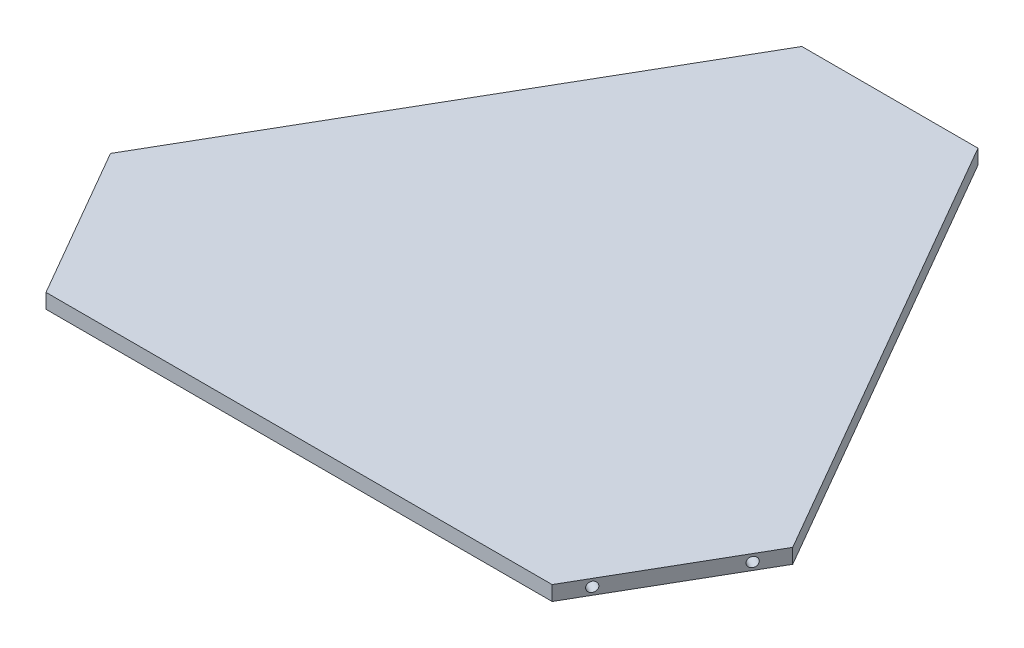
ISO-10303-21;
HEADER;
FILE_DESCRIPTION(('STEP AP214'),'2;1');
FILE_NAME('part.step','',(''),(''),'','','');
FILE_SCHEMA(('AUTOMOTIVE_DESIGN { 1 0 10303 214 1 1 1 1 }'));
ENDSEC;
DATA;
#1=APPLICATION_CONTEXT('core data for automotive mechanical design processes');
#2=APPLICATION_PROTOCOL_DEFINITION('international standard','automotive_design',2000,#1);
#3=PRODUCT_CONTEXT('',#1,'mechanical');
#4=PRODUCT('Part','Part','',(#3));
#5=PRODUCT_RELATED_PRODUCT_CATEGORY('part','',(#4));
#6=PRODUCT_DEFINITION_FORMATION('','',#4);
#7=PRODUCT_DEFINITION_CONTEXT('part definition',#1,'design');
#8=PRODUCT_DEFINITION('design','',#6,#7);
#9=PRODUCT_DEFINITION_SHAPE('','',#8);
#10=(LENGTH_UNIT() NAMED_UNIT(*) SI_UNIT(.MILLI.,.METRE.));
#11=(NAMED_UNIT(*) PLANE_ANGLE_UNIT() SI_UNIT($,.RADIAN.));
#12=(NAMED_UNIT(*) SI_UNIT($,.STERADIAN.) SOLID_ANGLE_UNIT());
#13=UNCERTAINTY_MEASURE_WITH_UNIT(LENGTH_MEASURE(1.E-05),#10,'distance_accuracy_value','');
#14=(GEOMETRIC_REPRESENTATION_CONTEXT(3) GLOBAL_UNCERTAINTY_ASSIGNED_CONTEXT((#13)) GLOBAL_UNIT_ASSIGNED_CONTEXT((#10,
#11,#12)) REPRESENTATION_CONTEXT('',''));
#15=CARTESIAN_POINT('',(0.,0.,0.));
#16=DIRECTION('',(0.,0.,1.));
#17=DIRECTION('',(1.,0.,0.));
#18=AXIS2_PLACEMENT_3D('',#15,#16,#17);
#19=CARTESIAN_POINT('',(-38.1,6.35,-148.4264));
#20=DIRECTION('',(0.866025403784439,0.,0.5));
#21=DIRECTION('',(0.5,0.,-0.866025403784439));
#22=AXIS2_PLACEMENT_3D('',#19,#20,#21);
#23=PLANE('',#22);
#24=DIRECTION('',(-0.5,0.,0.866025403784439));
#25=VECTOR('',#24,1.);
#26=CARTESIAN_POINT('',(-38.1,0.,-148.4264));
#27=LINE('',#26,#25);
#28=CARTESIAN_POINT('',(-38.1,0.,-148.4264));
#29=VERTEX_POINT('',#28);
#30=CARTESIAN_POINT('',(-147.59103299227,0.,41.2176321158125));
#31=VERTEX_POINT('',#30);
#32=EDGE_CURVE('E123',#29,#31,#27,.T.);
#33=ORIENTED_EDGE('',*,*,#32,.T.);
#34=DIRECTION('',(0.,-1.,0.));
#35=VECTOR('',#34,1.);
#36=CARTESIAN_POINT('',(-147.59103299227,6.35,41.2176321158125));
#37=LINE('',#36,#35);
#38=CARTESIAN_POINT('',(-147.59103299227,6.35,41.2176321158125));
#39=VERTEX_POINT('',#38);
#40=EDGE_CURVE('E11',#39,#31,#37,.T.);
#41=ORIENTED_EDGE('',*,*,#40,.F.);
#42=DIRECTION('',(-0.5,0.,0.866025403784439));
#43=VECTOR('',#42,1.);
#44=CARTESIAN_POINT('',(-38.1,6.35,-148.4264));
#45=LINE('',#44,#43);
#46=CARTESIAN_POINT('',(-38.1,6.35,-148.4264));
#47=VERTEX_POINT('',#46);
#48=EDGE_CURVE('E134',#47,#39,#45,.T.);
#49=ORIENTED_EDGE('',*,*,#48,.F.);
#50=DIRECTION('',(0.,-1.,0.));
#51=VECTOR('',#50,1.);
#52=CARTESIAN_POINT('',(-38.1,6.35,-148.4264));
#53=LINE('',#52,#51);
#54=EDGE_CURVE('E119',#47,#29,#53,.T.);
#55=ORIENTED_EDGE('',*,*,#54,.T.);
#56=EDGE_LOOP('',(#33,#41,#49,#55));
#57=FACE_BOUND('',#56,.T.);
#58=ADVANCED_FACE('F36',(#57),#23,.F.);
#59=CARTESIAN_POINT('',(-147.59103299227,6.35,41.2176321158125));
#60=DIRECTION('',(0.866025403784437,0.,-0.500000000000002));
#61=DIRECTION('',(-0.500000000000002,0.,-0.866025403784438));
#62=AXIS2_PLACEMENT_3D('',#59,#60,#61);
#63=PLANE('',#62);
#64=CARTESIAN_POINT('',(-141.241032992271,3.175,52.2161547438741));
#65=DIRECTION('',(-0.866025403784442,0.,0.499999999999995));
#66=DIRECTION('',(0.499999999999995,0.,0.866025403784442));
#67=AXIS2_PLACEMENT_3D('',#64,#65,#66);
#68=CIRCLE('',#67,2.09999999999999);
#69=CARTESIAN_POINT('',(-140.191032992271,3.175,54.0348080918214));
#70=VERTEX_POINT('',#69);
#71=EDGE_CURVE('E204',#70,#70,#68,.T.);
#72=ORIENTED_EDGE('',*,*,#71,.F.);
#73=EDGE_LOOP('',(#72));
#74=FACE_BOUND('',#73,.T.);
#75=CARTESIAN_POINT('',(-115.841032992271,3.175,96.2102452561238));
#76=DIRECTION('',(-0.866025403784442,0.,0.499999999999995));
#77=DIRECTION('',(0.499999999999995,0.,0.866025403784442));
#78=AXIS2_PLACEMENT_3D('',#75,#76,#77);
#79=CIRCLE('',#78,2.09999999999999);
#80=CARTESIAN_POINT('',(-114.791032992271,3.175,98.0288986040711));
#81=VERTEX_POINT('',#80);
#82=EDGE_CURVE('E198',#81,#81,#79,.T.);
#83=ORIENTED_EDGE('',*,*,#82,.F.);
#84=EDGE_LOOP('',(#83));
#85=FACE_BOUND('',#84,.T.);
#86=DIRECTION('',(0.500000000000002,0.,0.866025403784438));
#87=VECTOR('',#86,1.);
#88=CARTESIAN_POINT('',(-147.59103299227,0.,41.2176321158125));
#89=LINE('',#88,#87);
#90=CARTESIAN_POINT('',(-109.49103299227,0.,107.208767884187));
#91=VERTEX_POINT('',#90);
#92=EDGE_CURVE('E126',#31,#91,#89,.T.);
#93=ORIENTED_EDGE('',*,*,#92,.T.);
#94=DIRECTION('',(0.,-1.,0.));
#95=VECTOR('',#94,1.);
#96=CARTESIAN_POINT('',(-109.49103299227,6.35,107.208767884187));
#97=LINE('',#96,#95);
#98=CARTESIAN_POINT('',(-109.49103299227,6.35,107.208767884187));
#99=VERTEX_POINT('',#98);
#100=EDGE_CURVE('E44',#99,#91,#97,.T.);
#101=ORIENTED_EDGE('',*,*,#100,.F.);
#102=DIRECTION('',(0.500000000000002,0.,0.866025403784438));
#103=VECTOR('',#102,1.);
#104=CARTESIAN_POINT('',(-147.59103299227,6.35,41.2176321158125));
#105=LINE('',#104,#103);
#106=EDGE_CURVE('E90',#39,#99,#105,.T.);
#107=ORIENTED_EDGE('',*,*,#106,.F.);
#108=ORIENTED_EDGE('',*,*,#40,.T.);
#109=EDGE_LOOP('',(#93,#101,#107,#108));
#110=FACE_BOUND('',#109,.T.);
#111=ADVANCED_FACE('F161',(#74,#85,#110),#63,.F.);
#112=CARTESIAN_POINT('',(-109.49103299227,6.35,107.208767884187));
#113=DIRECTION('',(0.,0.,-1.));
#114=DIRECTION('',(-1.,0.,0.));
#115=AXIS2_PLACEMENT_3D('',#112,#113,#114);
#116=PLANE('',#115);
#117=DIRECTION('',(1.,0.,0.));
#118=VECTOR('',#117,1.);
#119=CARTESIAN_POINT('',(-109.49103299227,0.,107.208767884187));
#120=LINE('',#119,#118);
#121=CARTESIAN_POINT('',(109.49103299227,0.,107.208767884187));
#122=VERTEX_POINT('',#121);
#123=EDGE_CURVE('E129',#91,#122,#120,.T.);
#124=ORIENTED_EDGE('',*,*,#123,.T.);
#125=DIRECTION('',(0.,-1.,0.));
#126=VECTOR('',#125,1.);
#127=CARTESIAN_POINT('',(109.49103299227,6.35,107.208767884187));
#128=LINE('',#127,#126);
#129=CARTESIAN_POINT('',(109.49103299227,6.35,107.208767884187));
#130=VERTEX_POINT('',#129);
#131=EDGE_CURVE('E114',#130,#122,#128,.T.);
#132=ORIENTED_EDGE('',*,*,#131,.F.);
#133=DIRECTION('',(1.,0.,0.));
#134=VECTOR('',#133,1.);
#135=CARTESIAN_POINT('',(-109.49103299227,6.35,107.208767884187));
#136=LINE('',#135,#134);
#137=EDGE_CURVE('E105',#99,#130,#136,.T.);
#138=ORIENTED_EDGE('',*,*,#137,.F.);
#139=ORIENTED_EDGE('',*,*,#100,.T.);
#140=EDGE_LOOP('',(#124,#132,#138,#139));
#141=FACE_BOUND('',#140,.T.);
#142=ADVANCED_FACE('F140',(#141),#116,.F.);
#143=CARTESIAN_POINT('',(109.49103299227,6.35,107.208767884187));
#144=DIRECTION('',(-0.866025403784437,0.,-0.500000000000003));
#145=DIRECTION('',(-0.500000000000003,0.,0.866025403784437));
#146=AXIS2_PLACEMENT_3D('',#143,#144,#145);
#147=PLANE('',#146);
#148=CARTESIAN_POINT('',(115.84103299227,3.175,96.2102452561251));
#149=DIRECTION('',(0.866025403784438,0.,0.500000000000002));
#150=DIRECTION('',(0.500000000000002,0.,-0.866025403784438));
#151=AXIS2_PLACEMENT_3D('',#148,#149,#150);
#152=CIRCLE('',#151,2.09999999999999);
#153=CARTESIAN_POINT('',(116.89103299227,3.175,94.3915919081778));
#154=VERTEX_POINT('',#153);
#155=EDGE_CURVE('E180',#154,#154,#152,.T.);
#156=ORIENTED_EDGE('',*,*,#155,.F.);
#157=EDGE_LOOP('',(#156));
#158=FACE_BOUND('',#157,.T.);
#159=CARTESIAN_POINT('',(141.24103299227,3.175,52.2161547438757));
#160=DIRECTION('',(0.866025403784438,0.,0.500000000000002));
#161=DIRECTION('',(0.500000000000002,0.,-0.866025403784438));
#162=AXIS2_PLACEMENT_3D('',#159,#160,#161);
#163=CIRCLE('',#162,2.09999999999999);
#164=CARTESIAN_POINT('',(142.29103299227,3.175,50.3975013959284));
#165=VERTEX_POINT('',#164);
#166=EDGE_CURVE('E183',#165,#165,#163,.T.);
#167=ORIENTED_EDGE('',*,*,#166,.F.);
#168=EDGE_LOOP('',(#167));
#169=FACE_BOUND('',#168,.T.);
#170=DIRECTION('',(0.500000000000003,0.,-0.866025403784437));
#171=VECTOR('',#170,1.);
#172=CARTESIAN_POINT('',(109.49103299227,0.,107.208767884187));
#173=LINE('',#172,#171);
#174=CARTESIAN_POINT('',(147.591032992271,0.,41.217632115813));
#175=VERTEX_POINT('',#174);
#176=EDGE_CURVE('E113',#122,#175,#173,.T.);
#177=ORIENTED_EDGE('',*,*,#176,.T.);
#178=DIRECTION('',(0.,-1.,0.));
#179=VECTOR('',#178,1.);
#180=CARTESIAN_POINT('',(147.591032992271,6.35,41.217632115813));
#181=LINE('',#180,#179);
#182=CARTESIAN_POINT('',(147.591032992271,6.35,41.217632115813));
#183=VERTEX_POINT('',#182);
#184=EDGE_CURVE('E110',#183,#175,#181,.T.);
#185=ORIENTED_EDGE('',*,*,#184,.F.);
#186=DIRECTION('',(0.500000000000003,0.,-0.866025403784437));
#187=VECTOR('',#186,1.);
#188=CARTESIAN_POINT('',(109.49103299227,6.35,107.208767884187));
#189=LINE('',#188,#187);
#190=EDGE_CURVE('E99',#130,#183,#189,.T.);
#191=ORIENTED_EDGE('',*,*,#190,.F.);
#192=ORIENTED_EDGE('',*,*,#131,.T.);
#193=EDGE_LOOP('',(#177,#185,#191,#192));
#194=FACE_BOUND('',#193,.T.);
#195=ADVANCED_FACE('F111',(#158,#169,#194),#147,.F.);
#196=CARTESIAN_POINT('',(147.591032992271,6.35,41.217632115813));
#197=DIRECTION('',(-0.866025403784439,0.,0.5));
#198=DIRECTION('',(0.5,0.,0.866025403784439));
#199=AXIS2_PLACEMENT_3D('',#196,#197,#198);
#200=PLANE('',#199);
#201=DIRECTION('',(-0.5,0.,-0.866025403784439));
#202=VECTOR('',#201,1.);
#203=CARTESIAN_POINT('',(147.591032992271,0.,41.217632115813));
#204=LINE('',#203,#202);
#205=CARTESIAN_POINT('',(38.1,0.,-148.4264));
#206=VERTEX_POINT('',#205);
#207=EDGE_CURVE('E76',#175,#206,#204,.T.);
#208=ORIENTED_EDGE('',*,*,#207,.T.);
#209=DIRECTION('',(0.,-1.,0.));
#210=VECTOR('',#209,1.);
#211=CARTESIAN_POINT('',(38.1,6.35,-148.4264));
#212=LINE('',#211,#210);
#213=CARTESIAN_POINT('',(38.1,6.35,-148.4264));
#214=VERTEX_POINT('',#213);
#215=EDGE_CURVE('E115',#214,#206,#212,.T.);
#216=ORIENTED_EDGE('',*,*,#215,.F.);
#217=DIRECTION('',(-0.5,0.,-0.866025403784439));
#218=VECTOR('',#217,1.);
#219=CARTESIAN_POINT('',(147.591032992271,6.35,41.217632115813));
#220=LINE('',#219,#218);
#221=EDGE_CURVE('E103',#183,#214,#220,.T.);
#222=ORIENTED_EDGE('',*,*,#221,.F.);
#223=ORIENTED_EDGE('',*,*,#184,.T.);
#224=EDGE_LOOP('',(#208,#216,#222,#223));
#225=FACE_BOUND('',#224,.T.);
#226=ADVANCED_FACE('F117',(#225),#200,.F.);
#227=CARTESIAN_POINT('',(38.1,6.35,-148.4264));
#228=DIRECTION('',(0.,0.,1.));
#229=DIRECTION('',(1.,0.,0.));
#230=AXIS2_PLACEMENT_3D('',#227,#228,#229);
#231=PLANE('',#230);
#232=CARTESIAN_POINT('',(25.4000000000019,3.175,-148.4264));
#233=DIRECTION('',(0.,0.,-1.));
#234=DIRECTION('',(-1.,0.,0.));
#235=AXIS2_PLACEMENT_3D('',#232,#233,#234);
#236=CIRCLE('',#235,2.09999999999999);
#237=CARTESIAN_POINT('',(23.3000000000019,3.175,-148.4264));
#238=VERTEX_POINT('',#237);
#239=EDGE_CURVE('E216',#238,#238,#236,.T.);
#240=ORIENTED_EDGE('',*,*,#239,.F.);
#241=EDGE_LOOP('',(#240));
#242=FACE_BOUND('',#241,.T.);
#243=CARTESIAN_POINT('',(-25.3999999999981,3.175,-148.4264));
#244=DIRECTION('',(0.,0.,-1.));
#245=DIRECTION('',(-1.,0.,0.));
#246=AXIS2_PLACEMENT_3D('',#243,#244,#245);
#247=CIRCLE('',#246,2.09999999999999);
#248=CARTESIAN_POINT('',(-27.4999999999981,3.175,-148.4264));
#249=VERTEX_POINT('',#248);
#250=EDGE_CURVE('E210',#249,#249,#247,.T.);
#251=ORIENTED_EDGE('',*,*,#250,.F.);
#252=EDGE_LOOP('',(#251));
#253=FACE_BOUND('',#252,.T.);
#254=DIRECTION('',(-1.,0.,0.));
#255=VECTOR('',#254,1.);
#256=CARTESIAN_POINT('',(38.1,0.,-148.4264));
#257=LINE('',#256,#255);
#258=EDGE_CURVE('E82',#206,#29,#257,.T.);
#259=ORIENTED_EDGE('',*,*,#258,.T.);
#260=ORIENTED_EDGE('',*,*,#54,.F.);
#261=DIRECTION('',(-1.,0.,0.));
#262=VECTOR('',#261,1.);
#263=CARTESIAN_POINT('',(38.1,6.35,-148.4264));
#264=LINE('',#263,#262);
#265=EDGE_CURVE('E52',#214,#47,#264,.T.);
#266=ORIENTED_EDGE('',*,*,#265,.F.);
#267=ORIENTED_EDGE('',*,*,#215,.T.);
#268=EDGE_LOOP('',(#259,#260,#266,#267));
#269=FACE_BOUND('',#268,.T.);
#270=ADVANCED_FACE('F147',(#242,#253,#269),#231,.F.);
#271=CARTESIAN_POINT('',(0.,6.35,0.));
#272=DIRECTION('',(0.,1.,0.));
#273=DIRECTION('',(0.,0.,1.));
#274=AXIS2_PLACEMENT_3D('',#271,#272,#273);
#275=PLANE('',#274);
#276=ORIENTED_EDGE('',*,*,#48,.T.);
#277=ORIENTED_EDGE('',*,*,#106,.T.);
#278=ORIENTED_EDGE('',*,*,#137,.T.);
#279=ORIENTED_EDGE('',*,*,#190,.T.);
#280=ORIENTED_EDGE('',*,*,#221,.T.);
#281=ORIENTED_EDGE('',*,*,#265,.T.);
#282=EDGE_LOOP('',(#276,#277,#278,#279,#280,#281));
#283=FACE_BOUND('',#282,.T.);
#284=ADVANCED_FACE('F101',(#283),#275,.T.);
#285=CARTESIAN_POINT('',(0.,0.,0.));
#286=DIRECTION('',(0.,1.,0.));
#287=DIRECTION('',(0.,0.,1.));
#288=AXIS2_PLACEMENT_3D('',#285,#286,#287);
#289=PLANE('',#288);
#290=ORIENTED_EDGE('',*,*,#32,.F.);
#291=ORIENTED_EDGE('',*,*,#258,.F.);
#292=ORIENTED_EDGE('',*,*,#207,.F.);
#293=ORIENTED_EDGE('',*,*,#176,.F.);
#294=ORIENTED_EDGE('',*,*,#123,.F.);
#295=ORIENTED_EDGE('',*,*,#92,.F.);
#296=EDGE_LOOP('',(#290,#291,#292,#293,#294,#295));
#297=FACE_BOUND('',#296,.T.);
#298=ADVANCED_FACE('F143',(#297),#289,.F.);
#299=CARTESIAN_POINT('',(130.242510364208,3.175,45.8661547438757));
#300=DIRECTION('',(0.866025403784438,0.,0.500000000000002));
#301=DIRECTION('',(0.500000000000002,0.,-0.866025403784438));
#302=AXIS2_PLACEMENT_3D('',#299,#300,#301);
#303=CONICAL_SURFACE('',#302,2.1,1.02974425867666);
#304=CARTESIAN_POINT('',(129.149753187764,3.175,45.2352510938967));
#305=VERTEX_POINT('',#304);
#306=VERTEX_LOOP('',#305);
#307=FACE_BOUND('',#306,.T.);
#308=CARTESIAN_POINT('',(130.242510364208,3.175,45.8661547438757));
#309=DIRECTION('',(0.866025403784438,0.,0.500000000000002));
#310=DIRECTION('',(0.500000000000002,0.,-0.866025403784438));
#311=AXIS2_PLACEMENT_3D('',#308,#309,#310);
#312=CIRCLE('',#311,2.1);
#313=CARTESIAN_POINT('',(131.292510364208,3.175,44.0475013959284));
#314=VERTEX_POINT('',#313);
#315=EDGE_CURVE('E127',#314,#314,#312,.T.);
#316=ORIENTED_EDGE('',*,*,#315,.T.);
#317=EDGE_LOOP('',(#316));
#318=FACE_BOUND('',#317,.T.);
#319=ADVANCED_FACE('F266',(#307,#318),#303,.F.);
#320=CARTESIAN_POINT('',(141.24103299227,3.175,52.2161547438757));
#321=DIRECTION('',(0.866025403784438,0.,0.500000000000002));
#322=DIRECTION('',(0.500000000000002,0.,-0.866025403784438));
#323=AXIS2_PLACEMENT_3D('',#320,#321,#322);
#324=CYLINDRICAL_SURFACE('',#323,2.09999999999999);
#325=ORIENTED_EDGE('',*,*,#315,.F.);
#326=EDGE_LOOP('',(#325));
#327=FACE_BOUND('',#326,.T.);
#328=ORIENTED_EDGE('',*,*,#166,.T.);
#329=EDGE_LOOP('',(#328));
#330=FACE_BOUND('',#329,.T.);
#331=ADVANCED_FACE('F262',(#327,#330),#324,.F.);
#332=CARTESIAN_POINT('',(104.842510364208,3.175,89.8602452561251));
#333=DIRECTION('',(0.866025403784438,0.,0.500000000000002));
#334=DIRECTION('',(0.500000000000002,0.,-0.866025403784438));
#335=AXIS2_PLACEMENT_3D('',#332,#333,#334);
#336=CONICAL_SURFACE('',#335,2.1,1.02974425867666);
#337=CARTESIAN_POINT('',(103.749753187764,3.175,89.2293416061462));
#338=VERTEX_POINT('',#337);
#339=VERTEX_LOOP('',#338);
#340=FACE_BOUND('',#339,.T.);
#341=CARTESIAN_POINT('',(104.842510364208,3.175,89.8602452561251));
#342=DIRECTION('',(0.866025403784438,0.,0.500000000000002));
#343=DIRECTION('',(0.500000000000002,0.,-0.866025403784438));
#344=AXIS2_PLACEMENT_3D('',#341,#342,#343);
#345=CIRCLE('',#344,2.1);
#346=CARTESIAN_POINT('',(105.892510364208,3.175,88.0415919081778));
#347=VERTEX_POINT('',#346);
#348=EDGE_CURVE('E185',#347,#347,#345,.T.);
#349=ORIENTED_EDGE('',*,*,#348,.T.);
#350=EDGE_LOOP('',(#349));
#351=FACE_BOUND('',#350,.T.);
#352=ADVANCED_FACE('F258',(#340,#351),#336,.F.);
#353=CARTESIAN_POINT('',(115.84103299227,3.175,96.2102452561251));
#354=DIRECTION('',(0.866025403784438,0.,0.500000000000002));
#355=DIRECTION('',(0.500000000000002,0.,-0.866025403784438));
#356=AXIS2_PLACEMENT_3D('',#353,#354,#355);
#357=CYLINDRICAL_SURFACE('',#356,2.09999999999999);
#358=ORIENTED_EDGE('',*,*,#348,.F.);
#359=EDGE_LOOP('',(#358));
#360=FACE_BOUND('',#359,.T.);
#361=ORIENTED_EDGE('',*,*,#155,.T.);
#362=EDGE_LOOP('',(#361));
#363=FACE_BOUND('',#362,.T.);
#364=ADVANCED_FACE('F254',(#360,#363),#357,.F.);
#365=CARTESIAN_POINT('',(-104.842510364209,3.175,89.8602452561239));
#366=DIRECTION('',(-0.866025403784442,0.,0.499999999999995));
#367=DIRECTION('',(0.499999999999995,0.,0.866025403784442));
#368=AXIS2_PLACEMENT_3D('',#365,#366,#367);
#369=CONICAL_SURFACE('',#368,2.1,1.02974425867665);
#370=CARTESIAN_POINT('',(-103.749753187765,3.175,89.2293416061449));
#371=VERTEX_POINT('',#370);
#372=VERTEX_LOOP('',#371);
#373=FACE_BOUND('',#372,.T.);
#374=CARTESIAN_POINT('',(-104.842510364209,3.175,89.8602452561239));
#375=DIRECTION('',(-0.866025403784442,0.,0.499999999999995));
#376=DIRECTION('',(0.499999999999995,0.,0.866025403784442));
#377=AXIS2_PLACEMENT_3D('',#374,#375,#376);
#378=CIRCLE('',#377,2.1);
#379=CARTESIAN_POINT('',(-103.792510364209,3.175,91.6788986040712));
#380=VERTEX_POINT('',#379);
#381=EDGE_CURVE('E195',#380,#380,#378,.T.);
#382=ORIENTED_EDGE('',*,*,#381,.T.);
#383=EDGE_LOOP('',(#382));
#384=FACE_BOUND('',#383,.T.);
#385=ADVANCED_FACE('F250',(#373,#384),#369,.F.);
#386=CARTESIAN_POINT('',(-115.841032992271,3.175,96.2102452561238));
#387=DIRECTION('',(-0.866025403784442,0.,0.499999999999995));
#388=DIRECTION('',(0.499999999999995,0.,0.866025403784442));
#389=AXIS2_PLACEMENT_3D('',#386,#387,#388);
#390=CYLINDRICAL_SURFACE('',#389,2.09999999999999);
#391=ORIENTED_EDGE('',*,*,#381,.F.);
#392=EDGE_LOOP('',(#391));
#393=FACE_BOUND('',#392,.T.);
#394=ORIENTED_EDGE('',*,*,#82,.T.);
#395=EDGE_LOOP('',(#394));
#396=FACE_BOUND('',#395,.T.);
#397=ADVANCED_FACE('F246',(#393,#396),#390,.F.);
#398=CARTESIAN_POINT('',(-130.242510364209,3.175,45.8661547438742));
#399=DIRECTION('',(-0.866025403784442,0.,0.499999999999995));
#400=DIRECTION('',(0.499999999999995,0.,0.866025403784442));
#401=AXIS2_PLACEMENT_3D('',#398,#399,#400);
#402=CONICAL_SURFACE('',#401,2.1,1.02974425867666);
#403=CARTESIAN_POINT('',(-129.149753187764,3.175,45.2352510938953));
#404=VERTEX_POINT('',#403);
#405=VERTEX_LOOP('',#404);
#406=FACE_BOUND('',#405,.T.);
#407=CARTESIAN_POINT('',(-130.242510364209,3.175,45.8661547438742));
#408=DIRECTION('',(-0.866025403784442,0.,0.499999999999995));
#409=DIRECTION('',(0.499999999999995,0.,0.866025403784442));
#410=AXIS2_PLACEMENT_3D('',#407,#408,#409);
#411=CIRCLE('',#410,2.1);
#412=CARTESIAN_POINT('',(-129.192510364209,3.175,47.6848080918215));
#413=VERTEX_POINT('',#412);
#414=EDGE_CURVE('E201',#413,#413,#411,.T.);
#415=ORIENTED_EDGE('',*,*,#414,.T.);
#416=EDGE_LOOP('',(#415));
#417=FACE_BOUND('',#416,.T.);
#418=ADVANCED_FACE('F242',(#406,#417),#402,.F.);
#419=CARTESIAN_POINT('',(-141.241032992271,3.175,52.2161547438741));
#420=DIRECTION('',(-0.866025403784442,0.,0.499999999999995));
#421=DIRECTION('',(0.499999999999995,0.,0.866025403784442));
#422=AXIS2_PLACEMENT_3D('',#419,#420,#421);
#423=CYLINDRICAL_SURFACE('',#422,2.09999999999999);
#424=ORIENTED_EDGE('',*,*,#414,.F.);
#425=EDGE_LOOP('',(#424));
#426=FACE_BOUND('',#425,.T.);
#427=ORIENTED_EDGE('',*,*,#71,.T.);
#428=EDGE_LOOP('',(#427));
#429=FACE_BOUND('',#428,.T.);
#430=ADVANCED_FACE('F238',(#426,#429),#423,.F.);
#431=CARTESIAN_POINT('',(-25.3999999999981,3.175,-135.7264));
#432=DIRECTION('',(0.,0.,-1.));
#433=DIRECTION('',(-1.,0.,0.));
#434=AXIS2_PLACEMENT_3D('',#431,#432,#433);
#435=CONICAL_SURFACE('',#434,2.1,1.02974425867665);
#436=CARTESIAN_POINT('',(-25.3999999999981,3.175,-134.464592700042));
#437=VERTEX_POINT('',#436);
#438=VERTEX_LOOP('',#437);
#439=FACE_BOUND('',#438,.T.);
#440=CARTESIAN_POINT('',(-25.3999999999981,3.175,-135.7264));
#441=DIRECTION('',(0.,0.,-1.));
#442=DIRECTION('',(-1.,0.,0.));
#443=AXIS2_PLACEMENT_3D('',#440,#441,#442);
#444=CIRCLE('',#443,2.1);
#445=CARTESIAN_POINT('',(-27.4999999999981,3.175,-135.7264));
#446=VERTEX_POINT('',#445);
#447=EDGE_CURVE('E207',#446,#446,#444,.T.);
#448=ORIENTED_EDGE('',*,*,#447,.T.);
#449=EDGE_LOOP('',(#448));
#450=FACE_BOUND('',#449,.T.);
#451=ADVANCED_FACE('F234',(#439,#450),#435,.F.);
#452=CARTESIAN_POINT('',(-25.3999999999981,3.175,-148.4264));
#453=DIRECTION('',(0.,0.,-1.));
#454=DIRECTION('',(-1.,0.,0.));
#455=AXIS2_PLACEMENT_3D('',#452,#453,#454);
#456=CYLINDRICAL_SURFACE('',#455,2.09999999999999);
#457=ORIENTED_EDGE('',*,*,#447,.F.);
#458=EDGE_LOOP('',(#457));
#459=FACE_BOUND('',#458,.T.);
#460=ORIENTED_EDGE('',*,*,#250,.T.);
#461=EDGE_LOOP('',(#460));
#462=FACE_BOUND('',#461,.T.);
#463=ADVANCED_FACE('F227',(#459,#462),#456,.F.);
#464=CARTESIAN_POINT('',(25.4000000000019,3.175,-135.7264));
#465=DIRECTION('',(0.,0.,-1.));
#466=DIRECTION('',(-1.,0.,0.));
#467=AXIS2_PLACEMENT_3D('',#464,#465,#466);
#468=CONICAL_SURFACE('',#467,2.1,1.02974425867665);
#469=CARTESIAN_POINT('',(25.4000000000019,3.175,-134.464592700042));
#470=VERTEX_POINT('',#469);
#471=VERTEX_LOOP('',#470);
#472=FACE_BOUND('',#471,.T.);
#473=CARTESIAN_POINT('',(25.4000000000019,3.175,-135.7264));
#474=DIRECTION('',(0.,0.,-1.));
#475=DIRECTION('',(-1.,0.,0.));
#476=AXIS2_PLACEMENT_3D('',#473,#474,#475);
#477=CIRCLE('',#476,2.1);
#478=CARTESIAN_POINT('',(23.3000000000019,3.175,-135.7264));
#479=VERTEX_POINT('',#478);
#480=EDGE_CURVE('E213',#479,#479,#477,.T.);
#481=ORIENTED_EDGE('',*,*,#480,.T.);
#482=EDGE_LOOP('',(#481));
#483=FACE_BOUND('',#482,.T.);
#484=ADVANCED_FACE('F221',(#472,#483),#468,.F.);
#485=CARTESIAN_POINT('',(25.4000000000019,3.175,-148.4264));
#486=DIRECTION('',(0.,0.,-1.));
#487=DIRECTION('',(-1.,0.,0.));
#488=AXIS2_PLACEMENT_3D('',#485,#486,#487);
#489=CYLINDRICAL_SURFACE('',#488,2.09999999999999);
#490=ORIENTED_EDGE('',*,*,#480,.F.);
#491=EDGE_LOOP('',(#490));
#492=FACE_BOUND('',#491,.T.);
#493=ORIENTED_EDGE('',*,*,#239,.T.);
#494=EDGE_LOOP('',(#493));
#495=FACE_BOUND('',#494,.T.);
#496=ADVANCED_FACE('F219',(#492,#495),#489,.F.);
#497=CLOSED_SHELL('',(#58,#111,#142,#195,#226,#270,#284,#298,#319,#331,#352,#364,#385,#397,#418,
#430,#451,#463,#484,#496));
#498=MANIFOLD_SOLID_BREP('B2',#497);
#499=ADVANCED_BREP_SHAPE_REPRESENTATION('',(#18,#498),#14);
#500=SHAPE_DEFINITION_REPRESENTATION(#9,#499);
ENDSEC;
END-ISO-10303-21;
